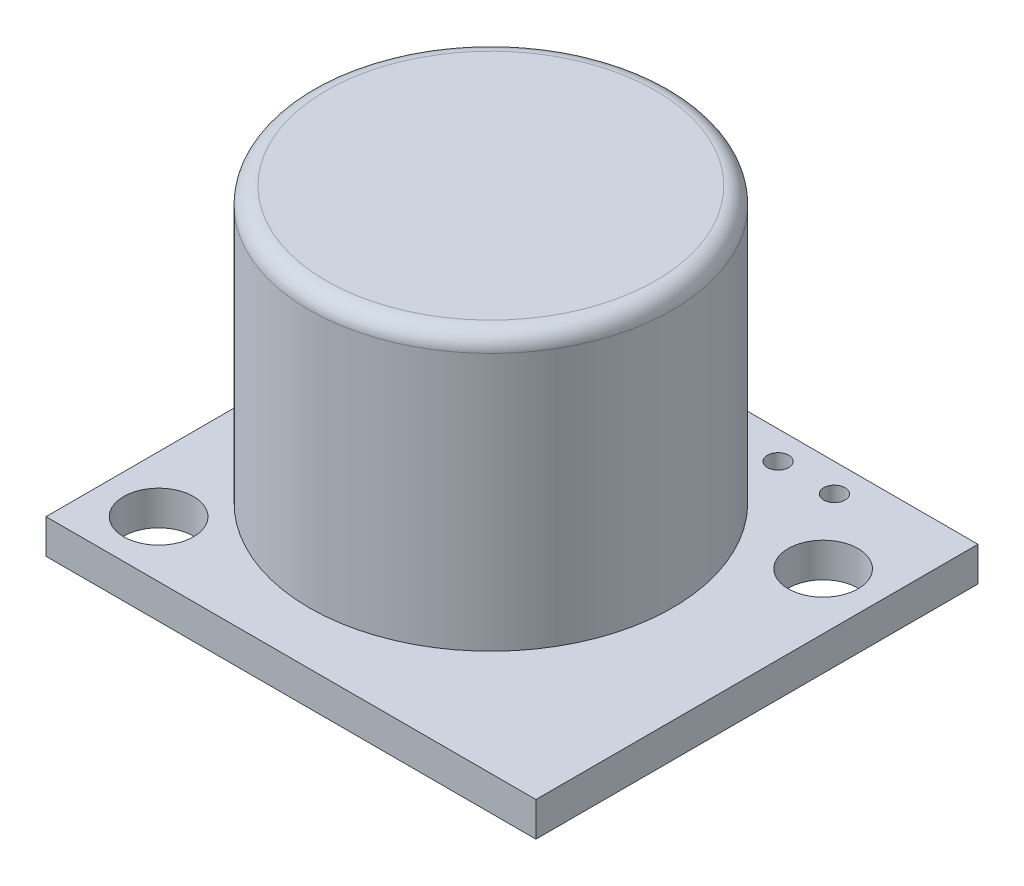
ISO-10303-21;
HEADER;
FILE_DESCRIPTION(('STEP AP214'),'2;1');
FILE_NAME('part.step','',(''),(''),'','','');
FILE_SCHEMA(('AUTOMOTIVE_DESIGN { 1 0 10303 214 1 1 1 1 }'));
ENDSEC;
DATA;
#1=APPLICATION_CONTEXT('core data for automotive mechanical design processes');
#2=APPLICATION_PROTOCOL_DEFINITION('international standard','automotive_design',2000,#1);
#3=PRODUCT_CONTEXT('',#1,'mechanical');
#4=PRODUCT('Part','Part','',(#3));
#5=PRODUCT_RELATED_PRODUCT_CATEGORY('part','',(#4));
#6=PRODUCT_DEFINITION_FORMATION('','',#4);
#7=PRODUCT_DEFINITION_CONTEXT('part definition',#1,'design');
#8=PRODUCT_DEFINITION('design','',#6,#7);
#9=PRODUCT_DEFINITION_SHAPE('','',#8);
#10=(LENGTH_UNIT() NAMED_UNIT(*) SI_UNIT(.MILLI.,.METRE.));
#11=(NAMED_UNIT(*) PLANE_ANGLE_UNIT() SI_UNIT($,.RADIAN.));
#12=(NAMED_UNIT(*) SI_UNIT($,.STERADIAN.) SOLID_ANGLE_UNIT());
#13=UNCERTAINTY_MEASURE_WITH_UNIT(LENGTH_MEASURE(1.E-05),#10,'distance_accuracy_value','');
#14=(GEOMETRIC_REPRESENTATION_CONTEXT(3) GLOBAL_UNCERTAINTY_ASSIGNED_CONTEXT((#13)) GLOBAL_UNIT_ASSIGNED_CONTEXT((#10,
#11,#12)) REPRESENTATION_CONTEXT('',''));
#15=CARTESIAN_POINT('',(0.,0.,0.));
#16=DIRECTION('',(0.,0.,1.));
#17=DIRECTION('',(1.,0.,0.));
#18=AXIS2_PLACEMENT_3D('',#15,#16,#17);
#19=CARTESIAN_POINT('',(0.,1.5494,0.));
#20=DIRECTION('',(1.,0.,0.));
#21=DIRECTION('',(0.,0.,-1.));
#22=AXIS2_PLACEMENT_3D('',#19,#20,#21);
#23=PLANE('',#22);
#24=DIRECTION('',(0.,0.,1.));
#25=VECTOR('',#24,1.);
#26=CARTESIAN_POINT('',(0.,0.,0.));
#27=LINE('',#26,#25);
#28=CARTESIAN_POINT('',(0.,0.,-19.939));
#29=VERTEX_POINT('',#28);
#30=CARTESIAN_POINT('',(0.,0.,0.));
#31=VERTEX_POINT('',#30);
#32=EDGE_CURVE('E101',#29,#31,#27,.T.);
#33=ORIENTED_EDGE('',*,*,#32,.T.);
#34=DIRECTION('',(0.,-1.,0.));
#35=VECTOR('',#34,1.);
#36=CARTESIAN_POINT('',(0.,1.5494,0.));
#37=LINE('',#36,#35);
#38=CARTESIAN_POINT('',(0.,1.5494,0.));
#39=VERTEX_POINT('',#38);
#40=EDGE_CURVE('E92',#39,#31,#37,.T.);
#41=ORIENTED_EDGE('',*,*,#40,.F.);
#42=DIRECTION('',(0.,0.,1.));
#43=VECTOR('',#42,1.);
#44=CARTESIAN_POINT('',(0.,1.5494,0.));
#45=LINE('',#44,#43);
#46=CARTESIAN_POINT('',(0.,1.5494,-19.939));
#47=VERTEX_POINT('',#46);
#48=EDGE_CURVE('E86',#47,#39,#45,.T.);
#49=ORIENTED_EDGE('',*,*,#48,.F.);
#50=DIRECTION('',(0.,-1.,0.));
#51=VECTOR('',#50,1.);
#52=CARTESIAN_POINT('',(0.,1.5494,-19.939));
#53=LINE('',#52,#51);
#54=EDGE_CURVE('E97',#47,#29,#53,.T.);
#55=ORIENTED_EDGE('',*,*,#54,.T.);
#56=EDGE_LOOP('',(#33,#41,#49,#55));
#57=FACE_BOUND('',#56,.T.);
#58=ADVANCED_FACE('F33',(#57),#23,.F.);
#59=CARTESIAN_POINT('',(0.,1.5494,0.));
#60=DIRECTION('',(0.,0.,-1.));
#61=DIRECTION('',(-1.,0.,0.));
#62=AXIS2_PLACEMENT_3D('',#59,#60,#61);
#63=PLANE('',#62);
#64=DIRECTION('',(1.,0.,0.));
#65=VECTOR('',#64,1.);
#66=CARTESIAN_POINT('',(0.,0.,0.));
#67=LINE('',#66,#65);
#68=CARTESIAN_POINT('',(22.098,0.,0.));
#69=VERTEX_POINT('',#68);
#70=EDGE_CURVE('E91',#31,#69,#67,.T.);
#71=ORIENTED_EDGE('',*,*,#70,.T.);
#72=DIRECTION('',(0.,-1.,0.));
#73=VECTOR('',#72,1.);
#74=CARTESIAN_POINT('',(22.098,1.5494,0.));
#75=LINE('',#74,#73);
#76=CARTESIAN_POINT('',(22.098,1.5494,0.));
#77=VERTEX_POINT('',#76);
#78=EDGE_CURVE('E89',#77,#69,#75,.T.);
#79=ORIENTED_EDGE('',*,*,#78,.F.);
#80=DIRECTION('',(1.,0.,0.));
#81=VECTOR('',#80,1.);
#82=CARTESIAN_POINT('',(0.,1.5494,0.));
#83=LINE('',#82,#81);
#84=EDGE_CURVE('E81',#39,#77,#83,.T.);
#85=ORIENTED_EDGE('',*,*,#84,.F.);
#86=ORIENTED_EDGE('',*,*,#40,.T.);
#87=EDGE_LOOP('',(#71,#79,#85,#86));
#88=FACE_BOUND('',#87,.T.);
#89=ADVANCED_FACE('F90',(#88),#63,.F.);
#90=CARTESIAN_POINT('',(22.098,1.5494,0.));
#91=DIRECTION('',(-1.,0.,0.));
#92=DIRECTION('',(0.,0.,1.));
#93=AXIS2_PLACEMENT_3D('',#90,#91,#92);
#94=PLANE('',#93);
#95=DIRECTION('',(0.,0.,-1.));
#96=VECTOR('',#95,1.);
#97=CARTESIAN_POINT('',(22.098,0.,0.));
#98=LINE('',#97,#96);
#99=CARTESIAN_POINT('',(22.098,0.,-19.939));
#100=VERTEX_POINT('',#99);
#101=EDGE_CURVE('E67',#69,#100,#98,.T.);
#102=ORIENTED_EDGE('',*,*,#101,.T.);
#103=DIRECTION('',(0.,-1.,0.));
#104=VECTOR('',#103,1.);
#105=CARTESIAN_POINT('',(22.098,1.5494,-19.939));
#106=LINE('',#105,#104);
#107=CARTESIAN_POINT('',(22.098,1.5494,-19.939));
#108=VERTEX_POINT('',#107);
#109=EDGE_CURVE('E93',#108,#100,#106,.T.);
#110=ORIENTED_EDGE('',*,*,#109,.F.);
#111=DIRECTION('',(0.,0.,-1.));
#112=VECTOR('',#111,1.);
#113=CARTESIAN_POINT('',(22.098,1.5494,0.));
#114=LINE('',#113,#112);
#115=EDGE_CURVE('E84',#77,#108,#114,.T.);
#116=ORIENTED_EDGE('',*,*,#115,.F.);
#117=ORIENTED_EDGE('',*,*,#78,.T.);
#118=EDGE_LOOP('',(#102,#110,#116,#117));
#119=FACE_BOUND('',#118,.T.);
#120=ADVANCED_FACE('F95',(#119),#94,.F.);
#121=CARTESIAN_POINT('',(0.,1.5494,-19.939));
#122=DIRECTION('',(0.,0.,1.));
#123=DIRECTION('',(1.,0.,0.));
#124=AXIS2_PLACEMENT_3D('',#121,#122,#123);
#125=PLANE('',#124);
#126=DIRECTION('',(-1.,0.,0.));
#127=VECTOR('',#126,1.);
#128=CARTESIAN_POINT('',(0.,0.,-19.939));
#129=LINE('',#128,#127);
#130=EDGE_CURVE('E73',#100,#29,#129,.T.);
#131=ORIENTED_EDGE('',*,*,#130,.T.);
#132=ORIENTED_EDGE('',*,*,#54,.F.);
#133=DIRECTION('',(-1.,0.,0.));
#134=VECTOR('',#133,1.);
#135=CARTESIAN_POINT('',(0.,1.5494,-19.939));
#136=LINE('',#135,#134);
#137=EDGE_CURVE('E50',#108,#47,#136,.T.);
#138=ORIENTED_EDGE('',*,*,#137,.F.);
#139=ORIENTED_EDGE('',*,*,#109,.T.);
#140=EDGE_LOOP('',(#131,#132,#138,#139));
#141=FACE_BOUND('',#140,.T.);
#142=ADVANCED_FACE('F191',(#141),#125,.F.);
#143=CARTESIAN_POINT('',(0.,1.5494,0.));
#144=DIRECTION('',(0.,-1.,0.));
#145=DIRECTION('',(0.,0.,-1.));
#146=AXIS2_PLACEMENT_3D('',#143,#144,#145);
#147=PLANE('',#146);
#148=CARTESIAN_POINT('',(2.54,1.5494,-2.54));
#149=DIRECTION('',(0.,1.,0.));
#150=DIRECTION('',(0.,0.,1.));
#151=AXIS2_PLACEMENT_3D('',#148,#149,#150);
#152=CIRCLE('',#151,1.5748);
#153=CARTESIAN_POINT('',(2.54,1.5494,-0.965200000000001));
#154=VERTEX_POINT('',#153);
#155=EDGE_CURVE('E138',#154,#154,#152,.T.);
#156=ORIENTED_EDGE('',*,*,#155,.F.);
#157=EDGE_LOOP('',(#156));
#158=FACE_BOUND('',#157,.T.);
#159=CARTESIAN_POINT('',(16.891,1.5494,-18.669));
#160=DIRECTION('',(0.,1.,0.));
#161=DIRECTION('',(0.,0.,1.));
#162=AXIS2_PLACEMENT_3D('',#159,#160,#161);
#163=CIRCLE('',#162,0.4826);
#164=CARTESIAN_POINT('',(16.891,1.5494,-18.1864));
#165=VERTEX_POINT('',#164);
#166=EDGE_CURVE('E151',#165,#165,#163,.T.);
#167=ORIENTED_EDGE('',*,*,#166,.F.);
#168=EDGE_LOOP('',(#167));
#169=FACE_BOUND('',#168,.T.);
#170=CARTESIAN_POINT('',(14.351,1.5494,-18.669));
#171=DIRECTION('',(0.,1.,0.));
#172=DIRECTION('',(0.,0.,1.));
#173=AXIS2_PLACEMENT_3D('',#170,#171,#172);
#174=CIRCLE('',#173,0.4826);
#175=CARTESIAN_POINT('',(14.351,1.5494,-18.1864));
#176=VERTEX_POINT('',#175);
#177=EDGE_CURVE('E157',#176,#176,#174,.T.);
#178=ORIENTED_EDGE('',*,*,#177,.F.);
#179=EDGE_LOOP('',(#178));
#180=FACE_BOUND('',#179,.T.);
#181=CARTESIAN_POINT('',(11.811,1.5494,-18.669));
#182=DIRECTION('',(0.,1.,0.));
#183=DIRECTION('',(0.,0.,1.));
#184=AXIS2_PLACEMENT_3D('',#181,#182,#183);
#185=CIRCLE('',#184,0.4826);
#186=CARTESIAN_POINT('',(11.811,1.5494,-18.1864));
#187=VERTEX_POINT('',#186);
#188=EDGE_CURVE('E163',#187,#187,#185,.T.);
#189=ORIENTED_EDGE('',*,*,#188,.F.);
#190=EDGE_LOOP('',(#189));
#191=FACE_BOUND('',#190,.T.);
#192=CARTESIAN_POINT('',(9.271,1.5494,-18.669));
#193=DIRECTION('',(0.,1.,0.));
#194=DIRECTION('',(0.,0.,1.));
#195=AXIS2_PLACEMENT_3D('',#192,#193,#194);
#196=CIRCLE('',#195,0.4826);
#197=CARTESIAN_POINT('',(9.271,1.5494,-18.1864));
#198=VERTEX_POINT('',#197);
#199=EDGE_CURVE('E169',#198,#198,#196,.T.);
#200=ORIENTED_EDGE('',*,*,#199,.F.);
#201=EDGE_LOOP('',(#200));
#202=FACE_BOUND('',#201,.T.);
#203=CARTESIAN_POINT('',(19.558,1.5494,-15.494));
#204=DIRECTION('',(0.,1.,0.));
#205=DIRECTION('',(0.,0.,1.));
#206=AXIS2_PLACEMENT_3D('',#203,#204,#205);
#207=CIRCLE('',#206,1.5748);
#208=CARTESIAN_POINT('',(19.558,1.5494,-13.9192));
#209=VERTEX_POINT('',#208);
#210=EDGE_CURVE('E132',#209,#209,#207,.T.);
#211=ORIENTED_EDGE('',*,*,#210,.F.);
#212=EDGE_LOOP('',(#211));
#213=FACE_BOUND('',#212,.T.);
#214=CARTESIAN_POINT('',(1.651,1.5494,-18.669));
#215=DIRECTION('',(0.,1.,0.));
#216=DIRECTION('',(0.,0.,1.));
#217=AXIS2_PLACEMENT_3D('',#214,#215,#216);
#218=CIRCLE('',#217,0.482600000000001);
#219=CARTESIAN_POINT('',(1.651,1.5494,-18.1864));
#220=VERTEX_POINT('',#219);
#221=EDGE_CURVE('E125',#220,#220,#218,.T.);
#222=ORIENTED_EDGE('',*,*,#221,.F.);
#223=EDGE_LOOP('',(#222));
#224=FACE_BOUND('',#223,.T.);
#225=CARTESIAN_POINT('',(4.191,1.5494,-18.669));
#226=DIRECTION('',(0.,1.,0.));
#227=DIRECTION('',(0.,0.,1.));
#228=AXIS2_PLACEMENT_3D('',#225,#226,#227);
#229=CIRCLE('',#228,0.4826);
#230=CARTESIAN_POINT('',(4.191,1.5494,-18.1864));
#231=VERTEX_POINT('',#230);
#232=EDGE_CURVE('E146',#231,#231,#229,.T.);
#233=ORIENTED_EDGE('',*,*,#232,.F.);
#234=EDGE_LOOP('',(#233));
#235=FACE_BOUND('',#234,.T.);
#236=CARTESIAN_POINT('',(6.731,1.5494,-18.669));
#237=DIRECTION('',(0.,1.,0.));
#238=DIRECTION('',(0.,0.,1.));
#239=AXIS2_PLACEMENT_3D('',#236,#237,#238);
#240=CIRCLE('',#239,0.4826);
#241=CARTESIAN_POINT('',(6.731,1.5494,-18.1864));
#242=VERTEX_POINT('',#241);
#243=EDGE_CURVE('E139',#242,#242,#240,.T.);
#244=ORIENTED_EDGE('',*,*,#243,.F.);
#245=EDGE_LOOP('',(#244));
#246=FACE_BOUND('',#245,.T.);
#247=CARTESIAN_POINT('',(11.049,1.5494,-9.017));
#248=DIRECTION('',(0.,1.,0.));
#249=DIRECTION('',(0.,0.,1.));
#250=AXIS2_PLACEMENT_3D('',#247,#248,#249);
#251=CIRCLE('',#250,5.08);
#252=CARTESIAN_POINT('',(11.049,1.5494,-3.937));
#253=VERTEX_POINT('',#252);
#254=EDGE_CURVE('E110',#253,#253,#251,.T.);
#255=ORIENTED_EDGE('',*,*,#254,.F.);
#256=EDGE_LOOP('',(#255));
#257=FACE_BOUND('',#256,.T.);
#258=ORIENTED_EDGE('',*,*,#48,.T.);
#259=ORIENTED_EDGE('',*,*,#84,.T.);
#260=ORIENTED_EDGE('',*,*,#115,.T.);
#261=ORIENTED_EDGE('',*,*,#137,.T.);
#262=EDGE_LOOP('',(#258,#259,#260,#261));
#263=FACE_BOUND('',#262,.T.);
#264=ADVANCED_FACE('F82',(#158,#169,#180,#191,#202,#213,#224,#235,#246,#257,#263),#147,.F.);
#265=CARTESIAN_POINT('',(0.,0.,0.));
#266=DIRECTION('',(0.,-1.,0.));
#267=DIRECTION('',(0.,0.,-1.));
#268=AXIS2_PLACEMENT_3D('',#265,#266,#267);
#269=PLANE('',#268);
#270=CARTESIAN_POINT('',(2.54,0.,-2.54));
#271=DIRECTION('',(0.,1.,0.));
#272=DIRECTION('',(0.,0.,1.));
#273=AXIS2_PLACEMENT_3D('',#270,#271,#272);
#274=CIRCLE('',#273,1.5748);
#275=CARTESIAN_POINT('',(2.54,0.,-0.965200000000001));
#276=VERTEX_POINT('',#275);
#277=EDGE_CURVE('E124',#276,#276,#274,.T.);
#278=ORIENTED_EDGE('',*,*,#277,.T.);
#279=EDGE_LOOP('',(#278));
#280=FACE_BOUND('',#279,.T.);
#281=CARTESIAN_POINT('',(16.891,0.,-18.669));
#282=DIRECTION('',(0.,1.,0.));
#283=DIRECTION('',(0.,0.,1.));
#284=AXIS2_PLACEMENT_3D('',#281,#282,#283);
#285=CIRCLE('',#284,0.4826);
#286=CARTESIAN_POINT('',(16.891,0.,-18.1864));
#287=VERTEX_POINT('',#286);
#288=EDGE_CURVE('E154',#287,#287,#285,.T.);
#289=ORIENTED_EDGE('',*,*,#288,.T.);
#290=EDGE_LOOP('',(#289));
#291=FACE_BOUND('',#290,.T.);
#292=CARTESIAN_POINT('',(14.351,0.,-18.669));
#293=DIRECTION('',(0.,1.,0.));
#294=DIRECTION('',(0.,0.,1.));
#295=AXIS2_PLACEMENT_3D('',#292,#293,#294);
#296=CIRCLE('',#295,0.4826);
#297=CARTESIAN_POINT('',(14.351,0.,-18.1864));
#298=VERTEX_POINT('',#297);
#299=EDGE_CURVE('E160',#298,#298,#296,.T.);
#300=ORIENTED_EDGE('',*,*,#299,.T.);
#301=EDGE_LOOP('',(#300));
#302=FACE_BOUND('',#301,.T.);
#303=CARTESIAN_POINT('',(11.811,0.,-18.669));
#304=DIRECTION('',(0.,1.,0.));
#305=DIRECTION('',(0.,0.,1.));
#306=AXIS2_PLACEMENT_3D('',#303,#304,#305);
#307=CIRCLE('',#306,0.4826);
#308=CARTESIAN_POINT('',(11.811,0.,-18.1864));
#309=VERTEX_POINT('',#308);
#310=EDGE_CURVE('E166',#309,#309,#307,.T.);
#311=ORIENTED_EDGE('',*,*,#310,.T.);
#312=EDGE_LOOP('',(#311));
#313=FACE_BOUND('',#312,.T.);
#314=CARTESIAN_POINT('',(9.271,0.,-18.669));
#315=DIRECTION('',(0.,1.,0.));
#316=DIRECTION('',(0.,0.,1.));
#317=AXIS2_PLACEMENT_3D('',#314,#315,#316);
#318=CIRCLE('',#317,0.4826);
#319=CARTESIAN_POINT('',(9.271,0.,-18.1864));
#320=VERTEX_POINT('',#319);
#321=EDGE_CURVE('E143',#320,#320,#318,.T.);
#322=ORIENTED_EDGE('',*,*,#321,.T.);
#323=EDGE_LOOP('',(#322));
#324=FACE_BOUND('',#323,.T.);
#325=CARTESIAN_POINT('',(19.558,0.,-15.494));
#326=DIRECTION('',(0.,1.,0.));
#327=DIRECTION('',(0.,0.,1.));
#328=AXIS2_PLACEMENT_3D('',#325,#326,#327);
#329=CIRCLE('',#328,1.5748);
#330=CARTESIAN_POINT('',(19.558,0.,-13.9192));
#331=VERTEX_POINT('',#330);
#332=EDGE_CURVE('E135',#331,#331,#329,.T.);
#333=ORIENTED_EDGE('',*,*,#332,.T.);
#334=EDGE_LOOP('',(#333));
#335=FACE_BOUND('',#334,.T.);
#336=CARTESIAN_POINT('',(1.651,0.,-18.669));
#337=DIRECTION('',(0.,1.,0.));
#338=DIRECTION('',(0.,0.,1.));
#339=AXIS2_PLACEMENT_3D('',#336,#337,#338);
#340=CIRCLE('',#339,0.482600000000001);
#341=CARTESIAN_POINT('',(1.651,0.,-18.1864));
#342=VERTEX_POINT('',#341);
#343=EDGE_CURVE('E128',#342,#342,#340,.T.);
#344=ORIENTED_EDGE('',*,*,#343,.T.);
#345=EDGE_LOOP('',(#344));
#346=FACE_BOUND('',#345,.T.);
#347=CARTESIAN_POINT('',(4.191,0.,-18.669));
#348=DIRECTION('',(0.,1.,0.));
#349=DIRECTION('',(0.,0.,1.));
#350=AXIS2_PLACEMENT_3D('',#347,#348,#349);
#351=CIRCLE('',#350,0.4826);
#352=CARTESIAN_POINT('',(4.191,0.,-18.1864));
#353=VERTEX_POINT('',#352);
#354=EDGE_CURVE('E129',#353,#353,#351,.T.);
#355=ORIENTED_EDGE('',*,*,#354,.T.);
#356=EDGE_LOOP('',(#355));
#357=FACE_BOUND('',#356,.T.);
#358=CARTESIAN_POINT('',(6.731,0.,-18.669));
#359=DIRECTION('',(0.,1.,0.));
#360=DIRECTION('',(0.,0.,1.));
#361=AXIS2_PLACEMENT_3D('',#358,#359,#360);
#362=CIRCLE('',#361,0.4826);
#363=CARTESIAN_POINT('',(6.731,0.,-18.1864));
#364=VERTEX_POINT('',#363);
#365=EDGE_CURVE('E142',#364,#364,#362,.T.);
#366=ORIENTED_EDGE('',*,*,#365,.T.);
#367=EDGE_LOOP('',(#366));
#368=FACE_BOUND('',#367,.T.);
#369=ORIENTED_EDGE('',*,*,#32,.F.);
#370=ORIENTED_EDGE('',*,*,#130,.F.);
#371=ORIENTED_EDGE('',*,*,#101,.F.);
#372=ORIENTED_EDGE('',*,*,#70,.F.);
#373=EDGE_LOOP('',(#369,#370,#371,#372));
#374=FACE_BOUND('',#373,.T.);
#375=ADVANCED_FACE('F179',(#280,#291,#302,#313,#324,#335,#346,#357,#368,#374),#269,.T.);
#376=CARTESIAN_POINT('',(11.049,3.0988,-9.017));
#377=DIRECTION('',(0.,-1.,0.));
#378=DIRECTION('',(0.,0.,-1.));
#379=AXIS2_PLACEMENT_3D('',#376,#377,#378);
#380=CYLINDRICAL_SURFACE('',#379,5.08);
#381=CARTESIAN_POINT('',(11.049,3.0988,-9.017));
#382=DIRECTION('',(0.,1.,0.));
#383=DIRECTION('',(0.,0.,1.));
#384=AXIS2_PLACEMENT_3D('',#381,#382,#383);
#385=CIRCLE('',#384,5.08);
#386=CARTESIAN_POINT('',(11.049,3.0988,-3.937));
#387=VERTEX_POINT('',#386);
#388=EDGE_CURVE('E104',#387,#387,#385,.T.);
#389=ORIENTED_EDGE('',*,*,#388,.F.);
#390=EDGE_LOOP('',(#389));
#391=FACE_BOUND('',#390,.T.);
#392=ORIENTED_EDGE('',*,*,#254,.T.);
#393=EDGE_LOOP('',(#392));
#394=FACE_BOUND('',#393,.T.);
#395=ADVANCED_FACE('F240',(#391,#394),#380,.T.);
#396=CARTESIAN_POINT('',(11.049,15.494,-9.017));
#397=DIRECTION('',(0.,-1.,0.));
#398=DIRECTION('',(0.,0.,-1.));
#399=AXIS2_PLACEMENT_3D('',#396,#397,#398);
#400=CYLINDRICAL_SURFACE('',#399,8.1915);
#401=CARTESIAN_POINT('',(11.049,14.732,-9.017));
#402=DIRECTION('',(0.,1.,0.));
#403=DIRECTION('',(0.,0.,1.));
#404=AXIS2_PLACEMENT_3D('',#401,#402,#403);
#405=CIRCLE('',#404,8.1915);
#406=CARTESIAN_POINT('',(11.049,14.732,-0.8255));
#407=VERTEX_POINT('',#406);
#408=EDGE_CURVE('E11',#407,#407,#405,.F.);
#409=ORIENTED_EDGE('',*,*,#408,.T.);
#410=EDGE_LOOP('',(#409));
#411=FACE_BOUND('',#410,.T.);
#412=CARTESIAN_POINT('',(11.049,3.0988,-9.017));
#413=DIRECTION('',(0.,1.,0.));
#414=DIRECTION('',(0.,0.,1.));
#415=AXIS2_PLACEMENT_3D('',#412,#413,#414);
#416=CIRCLE('',#415,8.1915);
#417=CARTESIAN_POINT('',(11.049,3.0988,-0.8255));
#418=VERTEX_POINT('',#417);
#419=EDGE_CURVE('E121',#418,#418,#416,.T.);
#420=ORIENTED_EDGE('',*,*,#419,.T.);
#421=EDGE_LOOP('',(#420));
#422=FACE_BOUND('',#421,.T.);
#423=ADVANCED_FACE('F244',(#411,#422),#400,.T.);
#424=CARTESIAN_POINT('',(11.049,15.494,-9.017));
#425=DIRECTION('',(0.,1.,0.));
#426=DIRECTION('',(0.,0.,1.));
#427=AXIS2_PLACEMENT_3D('',#424,#425,#426);
#428=PLANE('',#427);
#429=CARTESIAN_POINT('',(11.049,15.494,-9.017));
#430=DIRECTION('',(0.,1.,0.));
#431=DIRECTION('',(0.,0.,1.));
#432=AXIS2_PLACEMENT_3D('',#429,#430,#431);
#433=CIRCLE('',#432,7.4295);
#434=CARTESIAN_POINT('',(11.049,15.494,-1.5875));
#435=VERTEX_POINT('',#434);
#436=EDGE_CURVE('E42',#435,#435,#433,.T.);
#437=ORIENTED_EDGE('',*,*,#436,.T.);
#438=EDGE_LOOP('',(#437));
#439=FACE_BOUND('',#438,.T.);
#440=ADVANCED_FACE('F223',(#439),#428,.T.);
#441=CARTESIAN_POINT('',(11.049,3.0988,-9.017));
#442=DIRECTION('',(0.,1.,0.));
#443=DIRECTION('',(0.,0.,1.));
#444=AXIS2_PLACEMENT_3D('',#441,#442,#443);
#445=PLANE('',#444);
#446=ORIENTED_EDGE('',*,*,#388,.T.);
#447=EDGE_LOOP('',(#446));
#448=FACE_BOUND('',#447,.T.);
#449=ORIENTED_EDGE('',*,*,#419,.F.);
#450=EDGE_LOOP('',(#449));
#451=FACE_BOUND('',#450,.T.);
#452=ADVANCED_FACE('F213',(#448,#451),#445,.F.);
#453=CARTESIAN_POINT('',(6.731,0.,-18.669));
#454=DIRECTION('',(0.,1.,0.));
#455=DIRECTION('',(0.,0.,1.));
#456=AXIS2_PLACEMENT_3D('',#453,#454,#455);
#457=CYLINDRICAL_SURFACE('',#456,0.4826);
#458=ORIENTED_EDGE('',*,*,#365,.F.);
#459=EDGE_LOOP('',(#458));
#460=FACE_BOUND('',#459,.T.);
#461=ORIENTED_EDGE('',*,*,#243,.T.);
#462=EDGE_LOOP('',(#461));
#463=FACE_BOUND('',#462,.T.);
#464=ADVANCED_FACE('F210',(#460,#463),#457,.F.);
#465=CARTESIAN_POINT('',(4.191,0.,-18.669));
#466=DIRECTION('',(0.,1.,0.));
#467=DIRECTION('',(0.,0.,1.));
#468=AXIS2_PLACEMENT_3D('',#465,#466,#467);
#469=CYLINDRICAL_SURFACE('',#468,0.4826);
#470=ORIENTED_EDGE('',*,*,#354,.F.);
#471=EDGE_LOOP('',(#470));
#472=FACE_BOUND('',#471,.T.);
#473=ORIENTED_EDGE('',*,*,#232,.T.);
#474=EDGE_LOOP('',(#473));
#475=FACE_BOUND('',#474,.T.);
#476=ADVANCED_FACE('F212',(#472,#475),#469,.F.);
#477=CARTESIAN_POINT('',(1.651,0.,-18.669));
#478=DIRECTION('',(0.,1.,0.));
#479=DIRECTION('',(0.,0.,1.));
#480=AXIS2_PLACEMENT_3D('',#477,#478,#479);
#481=CYLINDRICAL_SURFACE('',#480,0.482600000000001);
#482=ORIENTED_EDGE('',*,*,#343,.F.);
#483=EDGE_LOOP('',(#482));
#484=FACE_BOUND('',#483,.T.);
#485=ORIENTED_EDGE('',*,*,#221,.T.);
#486=EDGE_LOOP('',(#485));
#487=FACE_BOUND('',#486,.T.);
#488=ADVANCED_FACE('F220',(#484,#487),#481,.F.);
#489=CARTESIAN_POINT('',(19.558,0.,-15.494));
#490=DIRECTION('',(0.,1.,0.));
#491=DIRECTION('',(0.,0.,1.));
#492=AXIS2_PLACEMENT_3D('',#489,#490,#491);
#493=CYLINDRICAL_SURFACE('',#492,1.5748);
#494=ORIENTED_EDGE('',*,*,#332,.F.);
#495=EDGE_LOOP('',(#494));
#496=FACE_BOUND('',#495,.T.);
#497=ORIENTED_EDGE('',*,*,#210,.T.);
#498=EDGE_LOOP('',(#497));
#499=FACE_BOUND('',#498,.T.);
#500=ADVANCED_FACE('F252',(#496,#499),#493,.F.);
#501=CARTESIAN_POINT('',(9.271,0.,-18.669));
#502=DIRECTION('',(0.,1.,0.));
#503=DIRECTION('',(0.,0.,1.));
#504=AXIS2_PLACEMENT_3D('',#501,#502,#503);
#505=CYLINDRICAL_SURFACE('',#504,0.4826);
#506=ORIENTED_EDGE('',*,*,#321,.F.);
#507=EDGE_LOOP('',(#506));
#508=FACE_BOUND('',#507,.T.);
#509=ORIENTED_EDGE('',*,*,#199,.T.);
#510=EDGE_LOOP('',(#509));
#511=FACE_BOUND('',#510,.T.);
#512=ADVANCED_FACE('F255',(#508,#511),#505,.F.);
#513=CARTESIAN_POINT('',(11.811,0.,-18.669));
#514=DIRECTION('',(0.,1.,0.));
#515=DIRECTION('',(0.,0.,1.));
#516=AXIS2_PLACEMENT_3D('',#513,#514,#515);
#517=CYLINDRICAL_SURFACE('',#516,0.4826);
#518=ORIENTED_EDGE('',*,*,#310,.F.);
#519=EDGE_LOOP('',(#518));
#520=FACE_BOUND('',#519,.T.);
#521=ORIENTED_EDGE('',*,*,#188,.T.);
#522=EDGE_LOOP('',(#521));
#523=FACE_BOUND('',#522,.T.);
#524=ADVANCED_FACE('F260',(#520,#523),#517,.F.);
#525=CARTESIAN_POINT('',(14.351,0.,-18.669));
#526=DIRECTION('',(0.,1.,0.));
#527=DIRECTION('',(0.,0.,1.));
#528=AXIS2_PLACEMENT_3D('',#525,#526,#527);
#529=CYLINDRICAL_SURFACE('',#528,0.4826);
#530=ORIENTED_EDGE('',*,*,#299,.F.);
#531=EDGE_LOOP('',(#530));
#532=FACE_BOUND('',#531,.T.);
#533=ORIENTED_EDGE('',*,*,#177,.T.);
#534=EDGE_LOOP('',(#533));
#535=FACE_BOUND('',#534,.T.);
#536=ADVANCED_FACE('F278',(#532,#535),#529,.F.);
#537=CARTESIAN_POINT('',(16.891,0.,-18.669));
#538=DIRECTION('',(0.,1.,0.));
#539=DIRECTION('',(0.,0.,1.));
#540=AXIS2_PLACEMENT_3D('',#537,#538,#539);
#541=CYLINDRICAL_SURFACE('',#540,0.4826);
#542=ORIENTED_EDGE('',*,*,#288,.F.);
#543=EDGE_LOOP('',(#542));
#544=FACE_BOUND('',#543,.T.);
#545=ORIENTED_EDGE('',*,*,#166,.T.);
#546=EDGE_LOOP('',(#545));
#547=FACE_BOUND('',#546,.T.);
#548=ADVANCED_FACE('F185',(#544,#547),#541,.F.);
#549=CARTESIAN_POINT('',(2.54,0.,-2.54));
#550=DIRECTION('',(0.,1.,0.));
#551=DIRECTION('',(0.,0.,1.));
#552=AXIS2_PLACEMENT_3D('',#549,#550,#551);
#553=CYLINDRICAL_SURFACE('',#552,1.5748);
#554=ORIENTED_EDGE('',*,*,#277,.F.);
#555=EDGE_LOOP('',(#554));
#556=FACE_BOUND('',#555,.T.);
#557=ORIENTED_EDGE('',*,*,#155,.T.);
#558=EDGE_LOOP('',(#557));
#559=FACE_BOUND('',#558,.T.);
#560=ADVANCED_FACE('F182',(#556,#559),#553,.F.);
#561=CARTESIAN_POINT('',(11.049,14.732,-9.017));
#562=DIRECTION('',(0.,1.,0.));
#563=DIRECTION('',(0.,0.,1.));
#564=AXIS2_PLACEMENT_3D('',#561,#562,#563);
#565=TOROIDAL_SURFACE('',#564,7.4295,0.762);
#566=ORIENTED_EDGE('',*,*,#408,.F.);
#567=EDGE_LOOP('',(#566));
#568=FACE_BOUND('',#567,.T.);
#569=ORIENTED_EDGE('',*,*,#436,.F.);
#570=EDGE_LOOP('',(#569));
#571=FACE_BOUND('',#570,.T.);
#572=ADVANCED_FACE('F35',(#568,#571),#565,.T.);
#573=CLOSED_SHELL('',(#58,#89,#120,#142,#264,#375,#395,#423,#440,#452,#464,#476,#488,#500,#512,
#524,#536,#548,#560,#572));
#574=MANIFOLD_SOLID_BREP('B2',#573);
#575=ADVANCED_BREP_SHAPE_REPRESENTATION('',(#18,#574),#14);
#576=SHAPE_DEFINITION_REPRESENTATION(#9,#575);
ENDSEC;
END-ISO-10303-21;
